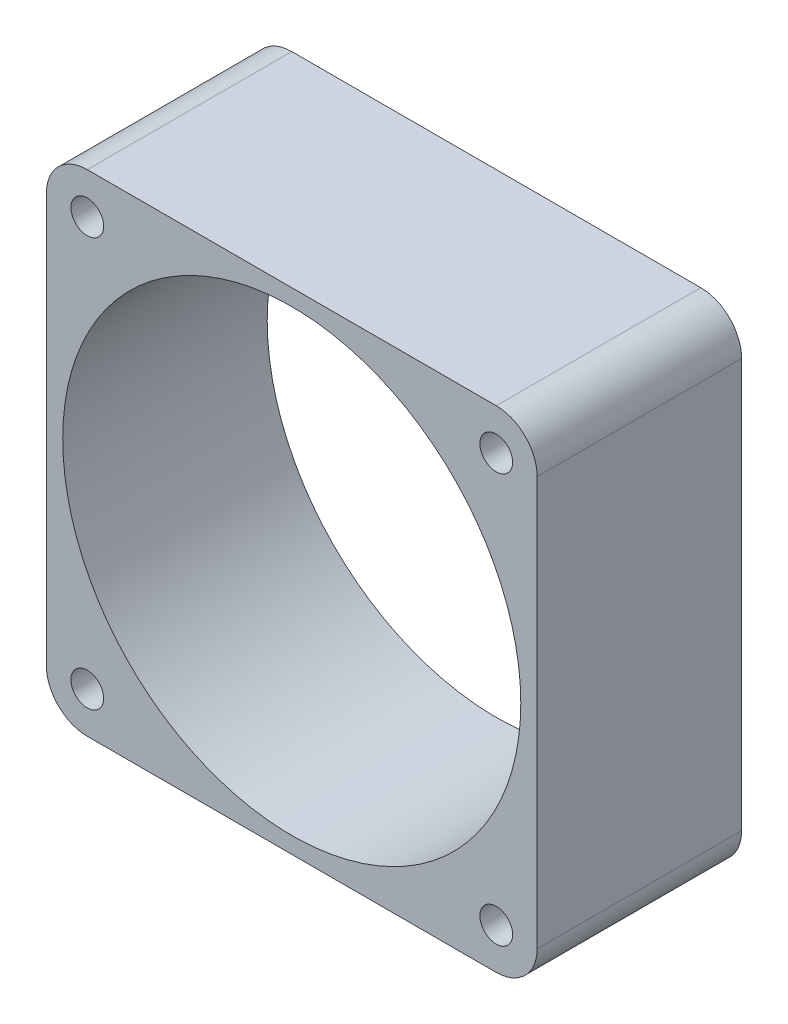
ISO-10303-21;
HEADER;
FILE_DESCRIPTION(('STEP AP214'),'2;1');
FILE_NAME('part.step','',(''),(''),'','','');
FILE_SCHEMA(('AUTOMOTIVE_DESIGN { 1 0 10303 214 1 1 1 1 }'));
ENDSEC;
DATA;
#1=APPLICATION_CONTEXT('core data for automotive mechanical design processes');
#2=APPLICATION_PROTOCOL_DEFINITION('international standard','automotive_design',2000,#1);
#3=PRODUCT_CONTEXT('',#1,'mechanical');
#4=PRODUCT('Part','Part','',(#3));
#5=PRODUCT_RELATED_PRODUCT_CATEGORY('part','',(#4));
#6=PRODUCT_DEFINITION_FORMATION('','',#4);
#7=PRODUCT_DEFINITION_CONTEXT('part definition',#1,'design');
#8=PRODUCT_DEFINITION('design','',#6,#7);
#9=PRODUCT_DEFINITION_SHAPE('','',#8);
#10=(LENGTH_UNIT() NAMED_UNIT(*) SI_UNIT(.MILLI.,.METRE.));
#11=(NAMED_UNIT(*) PLANE_ANGLE_UNIT() SI_UNIT($,.RADIAN.));
#12=(NAMED_UNIT(*) SI_UNIT($,.STERADIAN.) SOLID_ANGLE_UNIT());
#13=UNCERTAINTY_MEASURE_WITH_UNIT(LENGTH_MEASURE(1.E-05),#10,'distance_accuracy_value','');
#14=(GEOMETRIC_REPRESENTATION_CONTEXT(3) GLOBAL_UNCERTAINTY_ASSIGNED_CONTEXT((#13)) GLOBAL_UNIT_ASSIGNED_CONTEXT((#10,
#11,#12)) REPRESENTATION_CONTEXT('',''));
#15=CARTESIAN_POINT('',(0.,0.,0.));
#16=DIRECTION('',(0.,0.,1.));
#17=DIRECTION('',(1.,0.,0.));
#18=AXIS2_PLACEMENT_3D('',#15,#16,#17);
#19=CARTESIAN_POINT('',(-60.,60.,25.));
#20=DIRECTION('',(1.,0.,0.));
#21=DIRECTION('',(0.,0.,-1.));
#22=AXIS2_PLACEMENT_3D('',#19,#20,#21);
#23=PLANE('',#22);
#24=DIRECTION('',(0.,-1.,0.));
#25=VECTOR('',#24,1.);
#26=CARTESIAN_POINT('',(-60.,60.,0.));
#27=LINE('',#26,#25);
#28=CARTESIAN_POINT('',(-60.,55.,0.));
#29=VERTEX_POINT('',#28);
#30=CARTESIAN_POINT('',(-60.,5.,0.));
#31=VERTEX_POINT('',#30);
#32=EDGE_CURVE('E129',#29,#31,#27,.T.);
#33=ORIENTED_EDGE('',*,*,#32,.T.);
#34=DIRECTION('',(0.,0.,-1.));
#35=VECTOR('',#34,1.);
#36=CARTESIAN_POINT('',(-60.,5.,25.));
#37=LINE('',#36,#35);
#38=CARTESIAN_POINT('',(-60.,5.,25.));
#39=VERTEX_POINT('',#38);
#40=EDGE_CURVE('E152',#31,#39,#37,.F.);
#41=ORIENTED_EDGE('',*,*,#40,.T.);
#42=DIRECTION('',(0.,-1.,0.));
#43=VECTOR('',#42,1.);
#44=CARTESIAN_POINT('',(-60.,60.,25.));
#45=LINE('',#44,#43);
#46=CARTESIAN_POINT('',(-60.,55.,25.));
#47=VERTEX_POINT('',#46);
#48=EDGE_CURVE('E127',#47,#39,#45,.T.);
#49=ORIENTED_EDGE('',*,*,#48,.F.);
#50=DIRECTION('',(0.,0.,-1.));
#51=VECTOR('',#50,1.);
#52=CARTESIAN_POINT('',(-60.,55.,25.));
#53=LINE('',#52,#51);
#54=EDGE_CURVE('E149',#47,#29,#53,.T.);
#55=ORIENTED_EDGE('',*,*,#54,.T.);
#56=EDGE_LOOP('',(#33,#41,#49,#55));
#57=FACE_BOUND('',#56,.T.);
#58=ADVANCED_FACE('F34',(#57),#23,.F.);
#59=CARTESIAN_POINT('',(-60.,0.,25.));
#60=DIRECTION('',(0.,1.,0.));
#61=DIRECTION('',(0.,0.,1.));
#62=AXIS2_PLACEMENT_3D('',#59,#60,#61);
#63=PLANE('',#62);
#64=DIRECTION('',(1.,0.,0.));
#65=VECTOR('',#64,1.);
#66=CARTESIAN_POINT('',(-60.,0.,0.));
#67=LINE('',#66,#65);
#68=CARTESIAN_POINT('',(-55.,0.,0.));
#69=VERTEX_POINT('',#68);
#70=CARTESIAN_POINT('',(-5.00000000000001,0.,0.));
#71=VERTEX_POINT('',#70);
#72=EDGE_CURVE('E125',#69,#71,#67,.T.);
#73=ORIENTED_EDGE('',*,*,#72,.T.);
#74=DIRECTION('',(0.,0.,-1.));
#75=VECTOR('',#74,1.);
#76=CARTESIAN_POINT('',(-5.,0.,25.));
#77=LINE('',#76,#75);
#78=CARTESIAN_POINT('',(-5.00000000000001,0.,25.));
#79=VERTEX_POINT('',#78);
#80=EDGE_CURVE('E104',#71,#79,#77,.F.);
#81=ORIENTED_EDGE('',*,*,#80,.T.);
#82=DIRECTION('',(1.,0.,0.));
#83=VECTOR('',#82,1.);
#84=CARTESIAN_POINT('',(-60.,0.,25.));
#85=LINE('',#84,#83);
#86=CARTESIAN_POINT('',(-55.,0.,25.));
#87=VERTEX_POINT('',#86);
#88=EDGE_CURVE('E168',#87,#79,#85,.T.);
#89=ORIENTED_EDGE('',*,*,#88,.F.);
#90=DIRECTION('',(0.,0.,-1.));
#91=VECTOR('',#90,1.);
#92=CARTESIAN_POINT('',(-55.,0.,25.));
#93=LINE('',#92,#91);
#94=EDGE_CURVE('E109',#87,#69,#93,.T.);
#95=ORIENTED_EDGE('',*,*,#94,.T.);
#96=EDGE_LOOP('',(#73,#81,#89,#95));
#97=FACE_BOUND('',#96,.T.);
#98=ADVANCED_FACE('F244',(#97),#63,.F.);
#99=CARTESIAN_POINT('',(0.,60.,25.));
#100=DIRECTION('',(-1.,0.,0.));
#101=DIRECTION('',(0.,-1.,0.));
#102=AXIS2_PLACEMENT_3D('',#99,#100,#101);
#103=PLANE('',#102);
#104=DIRECTION('',(0.,1.,0.));
#105=VECTOR('',#104,1.);
#106=CARTESIAN_POINT('',(0.,60.,25.));
#107=LINE('',#106,#105);
#108=CARTESIAN_POINT('',(0.,5.,25.));
#109=VERTEX_POINT('',#108);
#110=CARTESIAN_POINT('',(0.,55.,25.));
#111=VERTEX_POINT('',#110);
#112=EDGE_CURVE('E118',#109,#111,#107,.T.);
#113=ORIENTED_EDGE('',*,*,#112,.F.);
#114=DIRECTION('',(0.,0.,-1.));
#115=VECTOR('',#114,1.);
#116=CARTESIAN_POINT('',(0.,5.,25.));
#117=LINE('',#116,#115);
#118=CARTESIAN_POINT('',(0.,5.,0.));
#119=VERTEX_POINT('',#118);
#120=EDGE_CURVE('E103',#109,#119,#117,.T.);
#121=ORIENTED_EDGE('',*,*,#120,.T.);
#122=DIRECTION('',(0.,1.,0.));
#123=VECTOR('',#122,1.);
#124=CARTESIAN_POINT('',(0.,60.,0.));
#125=LINE('',#124,#123);
#126=CARTESIAN_POINT('',(0.,55.,0.));
#127=VERTEX_POINT('',#126);
#128=EDGE_CURVE('E116',#119,#127,#125,.T.);
#129=ORIENTED_EDGE('',*,*,#128,.T.);
#130=DIRECTION('',(0.,0.,-1.));
#131=VECTOR('',#130,1.);
#132=CARTESIAN_POINT('',(0.,55.,25.));
#133=LINE('',#132,#131);
#134=EDGE_CURVE('E120',#127,#111,#133,.F.);
#135=ORIENTED_EDGE('',*,*,#134,.T.);
#136=EDGE_LOOP('',(#113,#121,#129,#135));
#137=FACE_BOUND('',#136,.T.);
#138=ADVANCED_FACE('F115',(#137),#103,.F.);
#139=CARTESIAN_POINT('',(-60.,60.,25.));
#140=DIRECTION('',(0.,-1.,0.));
#141=DIRECTION('',(0.,0.,-1.));
#142=AXIS2_PLACEMENT_3D('',#139,#140,#141);
#143=PLANE('',#142);
#144=DIRECTION('',(-1.,0.,0.));
#145=VECTOR('',#144,1.);
#146=CARTESIAN_POINT('',(-60.,60.,0.));
#147=LINE('',#146,#145);
#148=CARTESIAN_POINT('',(-5.00000000000001,60.,0.));
#149=VERTEX_POINT('',#148);
#150=CARTESIAN_POINT('',(-55.,60.,0.));
#151=VERTEX_POINT('',#150);
#152=EDGE_CURVE('E124',#149,#151,#147,.T.);
#153=ORIENTED_EDGE('',*,*,#152,.T.);
#154=DIRECTION('',(0.,0.,-1.));
#155=VECTOR('',#154,1.);
#156=CARTESIAN_POINT('',(-55.,60.,25.));
#157=LINE('',#156,#155);
#158=CARTESIAN_POINT('',(-55.,60.,25.));
#159=VERTEX_POINT('',#158);
#160=EDGE_CURVE('E11',#151,#159,#157,.F.);
#161=ORIENTED_EDGE('',*,*,#160,.T.);
#162=DIRECTION('',(-1.,0.,0.));
#163=VECTOR('',#162,1.);
#164=CARTESIAN_POINT('',(-60.,60.,25.));
#165=LINE('',#164,#163);
#166=CARTESIAN_POINT('',(-5.00000000000001,60.,25.));
#167=VERTEX_POINT('',#166);
#168=EDGE_CURVE('E133',#167,#159,#165,.T.);
#169=ORIENTED_EDGE('',*,*,#168,.F.);
#170=DIRECTION('',(0.,0.,-1.));
#171=VECTOR('',#170,1.);
#172=CARTESIAN_POINT('',(-5.,60.,25.));
#173=LINE('',#172,#171);
#174=EDGE_CURVE('E42',#167,#149,#173,.T.);
#175=ORIENTED_EDGE('',*,*,#174,.T.);
#176=EDGE_LOOP('',(#153,#161,#169,#175));
#177=FACE_BOUND('',#176,.T.);
#178=ADVANCED_FACE('F155',(#177),#143,.F.);
#179=CARTESIAN_POINT('',(0.,0.,25.));
#180=DIRECTION('',(0.,0.,1.));
#181=DIRECTION('',(1.,0.,0.));
#182=AXIS2_PLACEMENT_3D('',#179,#180,#181);
#183=PLANE('',#182);
#184=CARTESIAN_POINT('',(-5.,5.,25.));
#185=DIRECTION('',(0.,0.,-1.));
#186=DIRECTION('',(-1.,0.,0.));
#187=AXIS2_PLACEMENT_3D('',#184,#185,#186);
#188=CIRCLE('',#187,2.);
#189=CARTESIAN_POINT('',(-7.,5.,25.));
#190=VERTEX_POINT('',#189);
#191=EDGE_CURVE('E199',#190,#190,#188,.T.);
#192=ORIENTED_EDGE('',*,*,#191,.T.);
#193=EDGE_LOOP('',(#192));
#194=FACE_BOUND('',#193,.T.);
#195=CARTESIAN_POINT('',(-55.,5.,25.));
#196=DIRECTION('',(0.,0.,-1.));
#197=DIRECTION('',(-1.,0.,0.));
#198=AXIS2_PLACEMENT_3D('',#195,#196,#197);
#199=CIRCLE('',#198,2.);
#200=CARTESIAN_POINT('',(-57.,5.,25.));
#201=VERTEX_POINT('',#200);
#202=EDGE_CURVE('E193',#201,#201,#199,.T.);
#203=ORIENTED_EDGE('',*,*,#202,.T.);
#204=EDGE_LOOP('',(#203));
#205=FACE_BOUND('',#204,.T.);
#206=CARTESIAN_POINT('',(-55.,55.,25.));
#207=DIRECTION('',(0.,0.,-1.));
#208=DIRECTION('',(-1.,0.,0.));
#209=AXIS2_PLACEMENT_3D('',#206,#207,#208);
#210=CIRCLE('',#209,2.);
#211=CARTESIAN_POINT('',(-57.,55.,25.));
#212=VERTEX_POINT('',#211);
#213=EDGE_CURVE('E187',#212,#212,#210,.T.);
#214=ORIENTED_EDGE('',*,*,#213,.T.);
#215=EDGE_LOOP('',(#214));
#216=FACE_BOUND('',#215,.T.);
#217=CARTESIAN_POINT('',(-5.,55.,25.));
#218=DIRECTION('',(0.,0.,-1.));
#219=DIRECTION('',(-1.,0.,0.));
#220=AXIS2_PLACEMENT_3D('',#217,#218,#219);
#221=CIRCLE('',#220,2.);
#222=CARTESIAN_POINT('',(-7.,55.,25.));
#223=VERTEX_POINT('',#222);
#224=EDGE_CURVE('E182',#223,#223,#221,.T.);
#225=ORIENTED_EDGE('',*,*,#224,.T.);
#226=EDGE_LOOP('',(#225));
#227=FACE_BOUND('',#226,.T.);
#228=CARTESIAN_POINT('',(-30.,30.,25.));
#229=DIRECTION('',(0.,0.,1.));
#230=DIRECTION('',(1.,0.,0.));
#231=AXIS2_PLACEMENT_3D('',#228,#229,#230);
#232=CIRCLE('',#231,28.);
#233=CARTESIAN_POINT('',(-1.99999999999999,30.,25.));
#234=VERTEX_POINT('',#233);
#235=EDGE_CURVE('E173',#234,#234,#232,.F.);
#236=ORIENTED_EDGE('',*,*,#235,.T.);
#237=EDGE_LOOP('',(#236));
#238=FACE_BOUND('',#237,.T.);
#239=ORIENTED_EDGE('',*,*,#88,.T.);
#240=CARTESIAN_POINT('',(-5.,5.,25.));
#241=DIRECTION('',(0.,0.,1.));
#242=DIRECTION('',(1.,0.,0.));
#243=AXIS2_PLACEMENT_3D('',#240,#241,#242);
#244=CIRCLE('',#243,5.);
#245=EDGE_CURVE('E147',#79,#109,#244,.T.);
#246=ORIENTED_EDGE('',*,*,#245,.T.);
#247=ORIENTED_EDGE('',*,*,#112,.T.);
#248=CARTESIAN_POINT('',(-5.,55.,25.));
#249=DIRECTION('',(0.,0.,1.));
#250=DIRECTION('',(1.,0.,0.));
#251=AXIS2_PLACEMENT_3D('',#248,#249,#250);
#252=CIRCLE('',#251,5.);
#253=EDGE_CURVE('E54',#111,#167,#252,.T.);
#254=ORIENTED_EDGE('',*,*,#253,.T.);
#255=ORIENTED_EDGE('',*,*,#168,.T.);
#256=CARTESIAN_POINT('',(-55.,55.,25.));
#257=DIRECTION('',(0.,0.,1.));
#258=DIRECTION('',(1.,0.,0.));
#259=AXIS2_PLACEMENT_3D('',#256,#257,#258);
#260=CIRCLE('',#259,5.);
#261=EDGE_CURVE('E143',#159,#47,#260,.T.);
#262=ORIENTED_EDGE('',*,*,#261,.T.);
#263=ORIENTED_EDGE('',*,*,#48,.T.);
#264=CARTESIAN_POINT('',(-55.,5.,25.));
#265=DIRECTION('',(0.,0.,1.));
#266=DIRECTION('',(1.,0.,0.));
#267=AXIS2_PLACEMENT_3D('',#264,#265,#266);
#268=CIRCLE('',#267,5.);
#269=EDGE_CURVE('E145',#39,#87,#268,.T.);
#270=ORIENTED_EDGE('',*,*,#269,.T.);
#271=EDGE_LOOP('',(#239,#246,#247,#254,#255,#262,#263,#270));
#272=FACE_BOUND('',#271,.T.);
#273=ADVANCED_FACE('F208',(#194,#205,#216,#227,#238,#272),#183,.T.);
#274=CARTESIAN_POINT('',(0.,0.,0.));
#275=DIRECTION('',(0.,0.,1.));
#276=DIRECTION('',(1.,0.,0.));
#277=AXIS2_PLACEMENT_3D('',#274,#275,#276);
#278=PLANE('',#277);
#279=CARTESIAN_POINT('',(-5.,5.,0.));
#280=DIRECTION('',(0.,0.,-1.));
#281=DIRECTION('',(-1.,0.,0.));
#282=AXIS2_PLACEMENT_3D('',#279,#280,#281);
#283=CIRCLE('',#282,2.);
#284=CARTESIAN_POINT('',(-7.,5.,0.));
#285=VERTEX_POINT('',#284);
#286=EDGE_CURVE('E202',#285,#285,#283,.T.);
#287=ORIENTED_EDGE('',*,*,#286,.F.);
#288=EDGE_LOOP('',(#287));
#289=FACE_BOUND('',#288,.T.);
#290=CARTESIAN_POINT('',(-55.,5.,0.));
#291=DIRECTION('',(0.,0.,-1.));
#292=DIRECTION('',(-1.,0.,0.));
#293=AXIS2_PLACEMENT_3D('',#290,#291,#292);
#294=CIRCLE('',#293,2.);
#295=CARTESIAN_POINT('',(-57.,5.,0.));
#296=VERTEX_POINT('',#295);
#297=EDGE_CURVE('E196',#296,#296,#294,.T.);
#298=ORIENTED_EDGE('',*,*,#297,.F.);
#299=EDGE_LOOP('',(#298));
#300=FACE_BOUND('',#299,.T.);
#301=CARTESIAN_POINT('',(-55.,55.,0.));
#302=DIRECTION('',(0.,0.,-1.));
#303=DIRECTION('',(-1.,0.,0.));
#304=AXIS2_PLACEMENT_3D('',#301,#302,#303);
#305=CIRCLE('',#304,2.);
#306=CARTESIAN_POINT('',(-57.,55.,0.));
#307=VERTEX_POINT('',#306);
#308=EDGE_CURVE('E190',#307,#307,#305,.T.);
#309=ORIENTED_EDGE('',*,*,#308,.F.);
#310=EDGE_LOOP('',(#309));
#311=FACE_BOUND('',#310,.T.);
#312=CARTESIAN_POINT('',(-5.,55.,0.));
#313=DIRECTION('',(0.,0.,-1.));
#314=DIRECTION('',(-1.,0.,0.));
#315=AXIS2_PLACEMENT_3D('',#312,#313,#314);
#316=CIRCLE('',#315,2.);
#317=CARTESIAN_POINT('',(-7.,55.,0.));
#318=VERTEX_POINT('',#317);
#319=EDGE_CURVE('E184',#318,#318,#316,.T.);
#320=ORIENTED_EDGE('',*,*,#319,.F.);
#321=EDGE_LOOP('',(#320));
#322=FACE_BOUND('',#321,.T.);
#323=CARTESIAN_POINT('',(-30.,30.,0.));
#324=DIRECTION('',(0.,0.,-1.));
#325=DIRECTION('',(-1.,0.,0.));
#326=AXIS2_PLACEMENT_3D('',#323,#324,#325);
#327=CIRCLE('',#326,28.);
#328=CARTESIAN_POINT('',(-58.,30.,0.));
#329=VERTEX_POINT('',#328);
#330=EDGE_CURVE('E177',#329,#329,#327,.T.);
#331=ORIENTED_EDGE('',*,*,#330,.F.);
#332=EDGE_LOOP('',(#331));
#333=FACE_BOUND('',#332,.T.);
#334=ORIENTED_EDGE('',*,*,#128,.F.);
#335=CARTESIAN_POINT('',(-5.,5.,0.));
#336=DIRECTION('',(0.,0.,1.));
#337=DIRECTION('',(1.,0.,0.));
#338=AXIS2_PLACEMENT_3D('',#335,#336,#337);
#339=CIRCLE('',#338,5.);
#340=EDGE_CURVE('E99',#119,#71,#339,.F.);
#341=ORIENTED_EDGE('',*,*,#340,.T.);
#342=ORIENTED_EDGE('',*,*,#72,.F.);
#343=CARTESIAN_POINT('',(-55.,5.,0.));
#344=DIRECTION('',(0.,0.,1.));
#345=DIRECTION('',(1.,0.,0.));
#346=AXIS2_PLACEMENT_3D('',#343,#344,#345);
#347=CIRCLE('',#346,5.);
#348=EDGE_CURVE('E110',#69,#31,#347,.F.);
#349=ORIENTED_EDGE('',*,*,#348,.T.);
#350=ORIENTED_EDGE('',*,*,#32,.F.);
#351=CARTESIAN_POINT('',(-55.,55.,0.));
#352=DIRECTION('',(0.,0.,1.));
#353=DIRECTION('',(1.,0.,0.));
#354=AXIS2_PLACEMENT_3D('',#351,#352,#353);
#355=CIRCLE('',#354,5.);
#356=EDGE_CURVE('E136',#29,#151,#355,.F.);
#357=ORIENTED_EDGE('',*,*,#356,.T.);
#358=ORIENTED_EDGE('',*,*,#152,.F.);
#359=CARTESIAN_POINT('',(-5.,55.,0.));
#360=DIRECTION('',(0.,0.,1.));
#361=DIRECTION('',(1.,0.,0.));
#362=AXIS2_PLACEMENT_3D('',#359,#360,#361);
#363=CIRCLE('',#362,5.);
#364=EDGE_CURVE('E119',#149,#127,#363,.F.);
#365=ORIENTED_EDGE('',*,*,#364,.T.);
#366=EDGE_LOOP('',(#334,#341,#342,#349,#350,#357,#358,#365));
#367=FACE_BOUND('',#366,.T.);
#368=ADVANCED_FACE('F122',(#289,#300,#311,#322,#333,#367),#278,.F.);
#369=CARTESIAN_POINT('',(-30.,30.,25.001));
#370=DIRECTION('',(0.,0.,-1.));
#371=DIRECTION('',(-1.,0.,0.));
#372=AXIS2_PLACEMENT_3D('',#369,#370,#371);
#373=CYLINDRICAL_SURFACE('',#372,28.);
#374=ORIENTED_EDGE('',*,*,#235,.F.);
#375=EDGE_LOOP('',(#374));
#376=FACE_BOUND('',#375,.T.);
#377=ORIENTED_EDGE('',*,*,#330,.T.);
#378=EDGE_LOOP('',(#377));
#379=FACE_BOUND('',#378,.T.);
#380=ADVANCED_FACE('F220',(#376,#379),#373,.F.);
#381=CARTESIAN_POINT('',(-5.,55.,25.));
#382=DIRECTION('',(0.,0.,-1.));
#383=DIRECTION('',(-1.,0.,0.));
#384=AXIS2_PLACEMENT_3D('',#381,#382,#383);
#385=CYLINDRICAL_SURFACE('',#384,2.);
#386=ORIENTED_EDGE('',*,*,#224,.F.);
#387=EDGE_LOOP('',(#386));
#388=FACE_BOUND('',#387,.T.);
#389=ORIENTED_EDGE('',*,*,#319,.T.);
#390=EDGE_LOOP('',(#389));
#391=FACE_BOUND('',#390,.T.);
#392=ADVANCED_FACE('F229',(#388,#391),#385,.F.);
#393=CARTESIAN_POINT('',(-55.,55.,25.));
#394=DIRECTION('',(0.,0.,-1.));
#395=DIRECTION('',(-1.,0.,0.));
#396=AXIS2_PLACEMENT_3D('',#393,#394,#395);
#397=CYLINDRICAL_SURFACE('',#396,2.);
#398=ORIENTED_EDGE('',*,*,#213,.F.);
#399=EDGE_LOOP('',(#398));
#400=FACE_BOUND('',#399,.T.);
#401=ORIENTED_EDGE('',*,*,#308,.T.);
#402=EDGE_LOOP('',(#401));
#403=FACE_BOUND('',#402,.T.);
#404=ADVANCED_FACE('F231',(#400,#403),#397,.F.);
#405=CARTESIAN_POINT('',(-55.,5.,25.));
#406=DIRECTION('',(0.,0.,-1.));
#407=DIRECTION('',(-1.,0.,0.));
#408=AXIS2_PLACEMENT_3D('',#405,#406,#407);
#409=CYLINDRICAL_SURFACE('',#408,2.);
#410=ORIENTED_EDGE('',*,*,#202,.F.);
#411=EDGE_LOOP('',(#410));
#412=FACE_BOUND('',#411,.T.);
#413=ORIENTED_EDGE('',*,*,#297,.T.);
#414=EDGE_LOOP('',(#413));
#415=FACE_BOUND('',#414,.T.);
#416=ADVANCED_FACE('F214',(#412,#415),#409,.F.);
#417=CARTESIAN_POINT('',(-5.,5.,25.));
#418=DIRECTION('',(0.,0.,-1.));
#419=DIRECTION('',(-1.,0.,0.));
#420=AXIS2_PLACEMENT_3D('',#417,#418,#419);
#421=CYLINDRICAL_SURFACE('',#420,2.);
#422=ORIENTED_EDGE('',*,*,#191,.F.);
#423=EDGE_LOOP('',(#422));
#424=FACE_BOUND('',#423,.T.);
#425=ORIENTED_EDGE('',*,*,#286,.T.);
#426=EDGE_LOOP('',(#425));
#427=FACE_BOUND('',#426,.T.);
#428=ADVANCED_FACE('F211',(#424,#427),#421,.F.);
#429=CARTESIAN_POINT('',(-5.,5.,25.));
#430=DIRECTION('',(0.,0.,-1.));
#431=DIRECTION('',(-1.,0.,0.));
#432=AXIS2_PLACEMENT_3D('',#429,#430,#431);
#433=CYLINDRICAL_SURFACE('',#432,5.);
#434=ORIENTED_EDGE('',*,*,#245,.F.);
#435=ORIENTED_EDGE('',*,*,#80,.F.);
#436=ORIENTED_EDGE('',*,*,#340,.F.);
#437=ORIENTED_EDGE('',*,*,#120,.F.);
#438=EDGE_LOOP('',(#434,#435,#436,#437));
#439=FACE_BOUND('',#438,.T.);
#440=ADVANCED_FACE('F102',(#439),#433,.T.);
#441=CARTESIAN_POINT('',(-55.,5.,25.));
#442=DIRECTION('',(0.,0.,-1.));
#443=DIRECTION('',(-1.,0.,0.));
#444=AXIS2_PLACEMENT_3D('',#441,#442,#443);
#445=CYLINDRICAL_SURFACE('',#444,5.);
#446=ORIENTED_EDGE('',*,*,#269,.F.);
#447=ORIENTED_EDGE('',*,*,#40,.F.);
#448=ORIENTED_EDGE('',*,*,#348,.F.);
#449=ORIENTED_EDGE('',*,*,#94,.F.);
#450=EDGE_LOOP('',(#446,#447,#448,#449));
#451=FACE_BOUND('',#450,.T.);
#452=ADVANCED_FACE('F255',(#451),#445,.T.);
#453=CARTESIAN_POINT('',(-55.,55.,25.));
#454=DIRECTION('',(0.,0.,-1.));
#455=DIRECTION('',(-1.,0.,0.));
#456=AXIS2_PLACEMENT_3D('',#453,#454,#455);
#457=CYLINDRICAL_SURFACE('',#456,5.);
#458=ORIENTED_EDGE('',*,*,#261,.F.);
#459=ORIENTED_EDGE('',*,*,#160,.F.);
#460=ORIENTED_EDGE('',*,*,#356,.F.);
#461=ORIENTED_EDGE('',*,*,#54,.F.);
#462=EDGE_LOOP('',(#458,#459,#460,#461));
#463=FACE_BOUND('',#462,.T.);
#464=ADVANCED_FACE('F162',(#463),#457,.T.);
#465=CARTESIAN_POINT('',(-5.,55.,25.));
#466=DIRECTION('',(0.,0.,-1.));
#467=DIRECTION('',(-1.,0.,0.));
#468=AXIS2_PLACEMENT_3D('',#465,#466,#467);
#469=CYLINDRICAL_SURFACE('',#468,5.);
#470=ORIENTED_EDGE('',*,*,#253,.F.);
#471=ORIENTED_EDGE('',*,*,#134,.F.);
#472=ORIENTED_EDGE('',*,*,#364,.F.);
#473=ORIENTED_EDGE('',*,*,#174,.F.);
#474=EDGE_LOOP('',(#470,#471,#472,#473));
#475=FACE_BOUND('',#474,.T.);
#476=ADVANCED_FACE('F36',(#475),#469,.T.);
#477=CLOSED_SHELL('',(#58,#98,#138,#178,#273,#368,#380,#392,#404,#416,#428,#440,#452,#464,#476));
#478=MANIFOLD_SOLID_BREP('B2',#477);
#479=ADVANCED_BREP_SHAPE_REPRESENTATION('',(#18,#478),#14);
#480=SHAPE_DEFINITION_REPRESENTATION(#9,#479);
ENDSEC;
END-ISO-10303-21;
